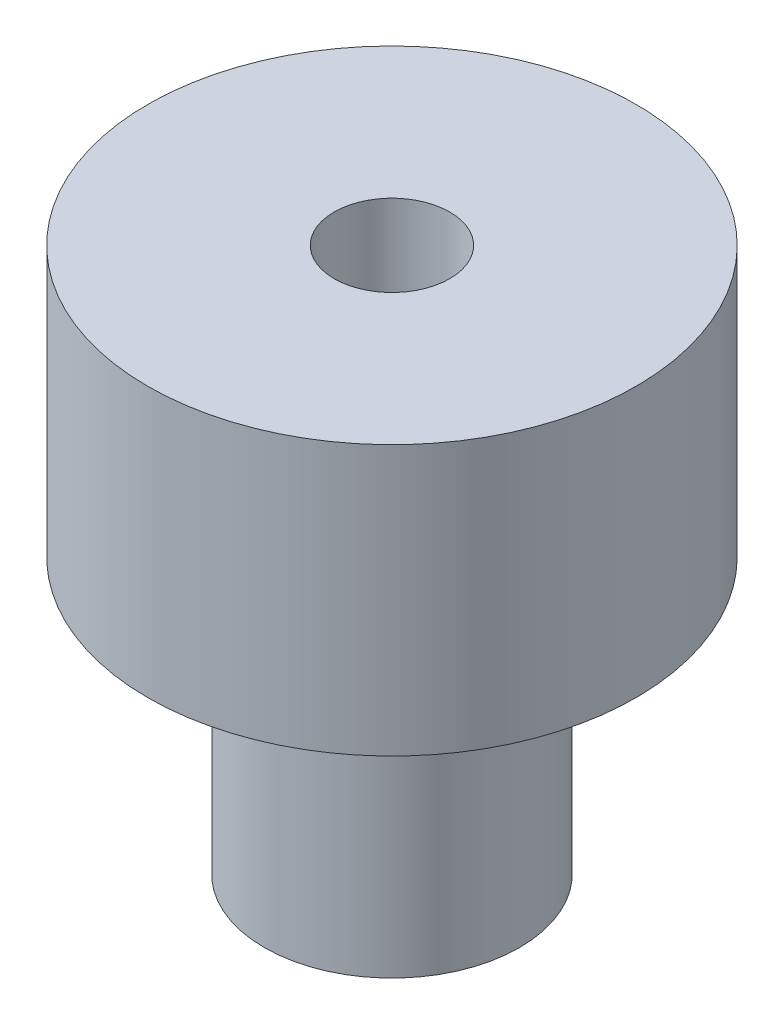
ISO-10303-21;
HEADER;
FILE_DESCRIPTION(('STEP AP214'),'2;1');
FILE_NAME('part.step','',(''),(''),'','','');
FILE_SCHEMA(('AUTOMOTIVE_DESIGN { 1 0 10303 214 1 1 1 1 }'));
ENDSEC;
DATA;
#1=APPLICATION_CONTEXT('core data for automotive mechanical design processes');
#2=APPLICATION_PROTOCOL_DEFINITION('international standard','automotive_design',2000,#1);
#3=PRODUCT_CONTEXT('',#1,'mechanical');
#4=PRODUCT('Part','Part','',(#3));
#5=PRODUCT_RELATED_PRODUCT_CATEGORY('part','',(#4));
#6=PRODUCT_DEFINITION_FORMATION('','',#4);
#7=PRODUCT_DEFINITION_CONTEXT('part definition',#1,'design');
#8=PRODUCT_DEFINITION('design','',#6,#7);
#9=PRODUCT_DEFINITION_SHAPE('','',#8);
#10=(LENGTH_UNIT() NAMED_UNIT(*) SI_UNIT(.MILLI.,.METRE.));
#11=(NAMED_UNIT(*) PLANE_ANGLE_UNIT() SI_UNIT($,.RADIAN.));
#12=(NAMED_UNIT(*) SI_UNIT($,.STERADIAN.) SOLID_ANGLE_UNIT());
#13=UNCERTAINTY_MEASURE_WITH_UNIT(LENGTH_MEASURE(1.E-05),#10,'distance_accuracy_value','');
#14=(GEOMETRIC_REPRESENTATION_CONTEXT(3) GLOBAL_UNCERTAINTY_ASSIGNED_CONTEXT((#13)) GLOBAL_UNIT_ASSIGNED_CONTEXT((#10,
#11,#12)) REPRESENTATION_CONTEXT('',''));
#15=CARTESIAN_POINT('',(0.,0.,0.));
#16=DIRECTION('',(0.,0.,1.));
#17=DIRECTION('',(1.,0.,0.));
#18=AXIS2_PLACEMENT_3D('',#15,#16,#17);
#19=CARTESIAN_POINT('',(0.,0.,0.));
#20=DIRECTION('',(0.,1.,0.));
#21=DIRECTION('',(0.,0.,1.));
#22=AXIS2_PLACEMENT_3D('',#19,#20,#21);
#23=PLANE('',#22);
#24=CARTESIAN_POINT('',(0.,0.,0.));
#25=DIRECTION('',(0.,1.,0.));
#26=DIRECTION('',(0.,0.,1.));
#27=AXIS2_PLACEMENT_3D('',#24,#25,#26);
#28=CIRCLE('',#27,6.7);
#29=CARTESIAN_POINT('',(0.,0.,6.7));
#30=VERTEX_POINT('',#29);
#31=EDGE_CURVE('E62',#30,#30,#28,.T.);
#32=ORIENTED_EDGE('',*,*,#31,.F.);
#33=EDGE_LOOP('',(#32));
#34=FACE_BOUND('',#33,.T.);
#35=CARTESIAN_POINT('',(0.,0.,0.));
#36=DIRECTION('',(0.,1.,0.));
#37=DIRECTION('',(0.,0.,1.));
#38=AXIS2_PLACEMENT_3D('',#35,#36,#37);
#39=CIRCLE('',#38,3.5);
#40=CARTESIAN_POINT('',(0.,0.,3.5));
#41=VERTEX_POINT('',#40);
#42=EDGE_CURVE('E10',#41,#41,#39,.F.);
#43=ORIENTED_EDGE('',*,*,#42,.F.);
#44=EDGE_LOOP('',(#43));
#45=FACE_BOUND('',#44,.T.);
#46=ADVANCED_FACE('F43',(#34,#45),#23,.F.);
#47=CARTESIAN_POINT('',(0.,7.4,0.));
#48=DIRECTION('',(0.,1.,0.));
#49=DIRECTION('',(0.,0.,1.));
#50=AXIS2_PLACEMENT_3D('',#47,#48,#49);
#51=PLANE('',#50);
#52=CARTESIAN_POINT('',(0.,7.4,0.));
#53=DIRECTION('',(0.,1.,0.));
#54=DIRECTION('',(0.,0.,1.));
#55=AXIS2_PLACEMENT_3D('',#52,#53,#54);
#56=CIRCLE('',#55,6.7);
#57=CARTESIAN_POINT('',(0.,7.4,6.7));
#58=VERTEX_POINT('',#57);
#59=EDGE_CURVE('E57',#58,#58,#56,.T.);
#60=ORIENTED_EDGE('',*,*,#59,.T.);
#61=EDGE_LOOP('',(#60));
#62=FACE_BOUND('',#61,.T.);
#63=CARTESIAN_POINT('',(0.,7.4,0.));
#64=DIRECTION('',(0.,1.,0.));
#65=DIRECTION('',(0.,0.,1.));
#66=AXIS2_PLACEMENT_3D('',#63,#64,#65);
#67=CIRCLE('',#66,1.586);
#68=CARTESIAN_POINT('',(0.,7.4,1.586));
#69=VERTEX_POINT('',#68);
#70=EDGE_CURVE('E67',#69,#69,#67,.T.);
#71=ORIENTED_EDGE('',*,*,#70,.F.);
#72=EDGE_LOOP('',(#71));
#73=FACE_BOUND('',#72,.T.);
#74=ADVANCED_FACE('F109',(#62,#73),#51,.T.);
#75=CARTESIAN_POINT('',(0.,7.4,0.));
#76=DIRECTION('',(0.,-1.,0.));
#77=DIRECTION('',(0.,0.,-1.));
#78=AXIS2_PLACEMENT_3D('',#75,#76,#77);
#79=CYLINDRICAL_SURFACE('',#78,6.7);
#80=ORIENTED_EDGE('',*,*,#59,.F.);
#81=EDGE_LOOP('',(#80));
#82=FACE_BOUND('',#81,.T.);
#83=ORIENTED_EDGE('',*,*,#31,.T.);
#84=EDGE_LOOP('',(#83));
#85=FACE_BOUND('',#84,.T.);
#86=ADVANCED_FACE('F45',(#82,#85),#79,.T.);
#87=CARTESIAN_POINT('',(0.,7.4,0.));
#88=DIRECTION('',(0.,-1.,0.));
#89=DIRECTION('',(0.,0.,-1.));
#90=AXIS2_PLACEMENT_3D('',#87,#88,#89);
#91=CYLINDRICAL_SURFACE('',#90,1.586);
#92=CARTESIAN_POINT('',(-0.976163920660868,-3.77,-1.25));
#93=CARTESIAN_POINT('',(-0.976178144988395,-3.72215570902188,-1.24999348367566));
#94=CARTESIAN_POINT('',(-0.979753609791022,-3.67424286982223,-1.24722200464479));
#95=CARTESIAN_POINT('',(-0.993389512883445,-3.5799075950233,-1.23638226412492));
#96=CARTESIAN_POINT('',(-1.00347128585963,-3.53349059203715,-1.22829657532019));
#97=CARTESIAN_POINT('',(-1.03271642932617,-3.42798329293562,-1.20389381365313));
#98=CARTESIAN_POINT('',(-1.05379190652301,-3.36986611649042,-1.18572519301987));
#99=CARTESIAN_POINT('',(-1.10087332936009,-3.2585427689267,-1.14214974593277));
#100=CARTESIAN_POINT('',(-1.12689266322267,-3.20535053043537,-1.11672316839289));
#101=CARTESIAN_POINT('',(-1.19015361848097,-3.08671796004963,-1.04962267083795));
#102=CARTESIAN_POINT('',(-1.22822503181856,-3.02318027040077,-1.00536066722319));
#103=CARTESIAN_POINT('',(-1.30347069374753,-2.90501971582949,-0.905686359127173));
#104=CARTESIAN_POINT('',(-1.34064564511565,-2.85038966049071,-0.850283129560191));
#105=CARTESIAN_POINT('',(-1.40377282323898,-2.76080267075664,-0.740292597501888));
#106=CARTESIAN_POINT('',(-1.43050858345585,-2.72408272943749,-0.687596452138823));
#107=CARTESIAN_POINT('',(-1.47914865475783,-2.65848332231729,-0.575526185755475));
#108=CARTESIAN_POINT('',(-1.50106032765397,-2.6295918940241,-0.516162451879478));
#109=CARTESIAN_POINT('',(-1.53528427502846,-2.58493799161107,-0.401606379457895));
#110=CARTESIAN_POINT('',(-1.54856572237825,-2.567823179102,-0.347234038802782));
#111=CARTESIAN_POINT('',(-1.56942552638147,-2.54106896101829,-0.235616354190177));
#112=CARTESIAN_POINT('',(-1.57700694781528,-2.5314255381542,-0.178372571832662));
#113=CARTESIAN_POINT('',(-1.58584065948328,-2.52019728217196,-0.062415795842604));
#114=CARTESIAN_POINT('',(-1.58707252734326,-2.51863845181772,-0.00369867109623077));
#115=CARTESIAN_POINT('',(-1.58303863653243,-2.52375853903996,0.113148243199622));
#116=CARTESIAN_POINT('',(-1.57777239234197,-2.53043807216249,0.171277988534665));
#117=CARTESIAN_POINT('',(-1.56163097790451,-2.55105227535869,0.282305852081883));
#118=CARTESIAN_POINT('',(-1.55105136603739,-2.56460497621132,0.335320037060864));
#119=CARTESIAN_POINT('',(-1.525215724929,-2.59803614998334,0.43809109978684));
#120=CARTESIAN_POINT('',(-1.50995854849615,-2.61791617475014,0.487847174832266));
#121=CARTESIAN_POINT('',(-1.47398614683566,-2.66546150301338,0.588109903328604));
#122=CARTESIAN_POINT('',(-1.4528791071093,-2.69370429017096,0.638199440052203));
#123=CARTESIAN_POINT('',(-1.40741280950753,-2.7559163547773,0.733046036769301));
#124=CARTESIAN_POINT('',(-1.38305152003341,-2.78988921296571,0.777799732344243));
#125=CARTESIAN_POINT('',(-1.32716389958939,-2.87029303325918,0.87035558701911));
#126=CARTESIAN_POINT('',(-1.29519137530749,-2.91785078926492,0.916908116293664));
#127=CARTESIAN_POINT('',(-1.23067279001101,-3.01952455054259,1.00183996843646));
#128=CARTESIAN_POINT('',(-1.19812615586322,-3.07364746827907,1.040210557265));
#129=CARTESIAN_POINT('',(-1.13930938455981,-3.18102885485554,1.10408735309203));
#130=CARTESIAN_POINT('',(-1.11276563070332,-3.23353360583929,1.13060614320518));
#131=CARTESIAN_POINT('',(-1.06413196833484,-3.34350263483498,1.17649178605274));
#132=CARTESIAN_POINT('',(-1.04203230276013,-3.40095564352018,1.19587438595147));
#133=CARTESIAN_POINT('',(-1.01090436561627,-3.50405053343067,1.22219779601514));
#134=CARTESIAN_POINT('',(-0.999952783472872,-3.54859635800478,1.23109422014854));
#135=CARTESIAN_POINT('',(-0.98385693978719,-3.63938508126608,1.24399829648119));
#136=CARTESIAN_POINT('',(-0.978700967586157,-3.68562436209936,1.24801580837796));
#137=CARTESIAN_POINT('',(-0.975091266979015,-3.77874431333341,1.25083991444511));
#138=CARTESIAN_POINT('',(-0.976667114298413,-3.82562691017024,1.24962351365766));
#139=CARTESIAN_POINT('',(-0.986284142516629,-3.91831835340678,1.24204387009674));
#140=CARTESIAN_POINT('',(-0.994334813921868,-3.96412552198407,1.23567307215736));
#141=CARTESIAN_POINT('',(-1.01861296654447,-4.06631583491505,1.21578316936733));
#142=CARTESIAN_POINT('',(-1.03651729331956,-4.12199083993832,1.20074390187717));
#143=CARTESIAN_POINT('',(-1.07758474078272,-4.22908468830603,1.16403020694476));
#144=CARTESIAN_POINT('',(-1.10076403795871,-4.28048976113271,1.14233529621039));
#145=CARTESIAN_POINT('',(-1.1597930099853,-4.39918136873437,1.08289795329103));
#146=CARTESIAN_POINT('',(-1.19694388286759,-4.46434965684497,1.04222218955419));
#147=CARTESIAN_POINT('',(-1.27148481436731,-4.58613246492364,0.949873129998355));
#148=CARTESIAN_POINT('',(-1.30887483801465,-4.64274820698152,0.898201407959525));
#149=CARTESIAN_POINT('',(-1.37492498640457,-4.7387818821577,0.792627382236269));
#150=CARTESIAN_POINT('',(-1.40405471944933,-4.77950549330536,0.740212236065973));
#151=CARTESIAN_POINT('',(-1.45771693052088,-4.85289814296488,0.627942386310541));
#152=CARTESIAN_POINT('',(-1.48225720504108,-4.88558087155727,0.56810059213634));
#153=CARTESIAN_POINT('',(-1.52089901836077,-4.9363863884743,0.453062756943354));
#154=CARTESIAN_POINT('',(-1.53607935872867,-4.95606231372047,0.398918895409617));
#155=CARTESIAN_POINT('',(-1.56081938370374,-4.98793390505201,0.287231371027705));
#156=CARTESIAN_POINT('',(-1.57038228831186,-5.0001338566545,0.229689676729863));
#157=CARTESIAN_POINT('',(-1.58310687255644,-5.01633740111198,0.112494709102673));
#158=CARTESIAN_POINT('',(-1.58624115973767,-5.0203059204907,0.0528334972756729));
#159=CARTESIAN_POINT('',(-1.58572977925648,-5.01965720679702,-0.0664115082476604));
#160=CARTESIAN_POINT('',(-1.58208462047243,-5.01504061813948,-0.125995307418792));
#161=CARTESIAN_POINT('',(-1.56883709021762,-4.99816052825333,-0.239096397069633));
#162=CARTESIAN_POINT('',(-1.55966247663154,-4.98644581726369,-0.292748812661035));
#163=CARTESIAN_POINT('',(-1.53642061225964,-4.95649956147478,-0.397072546845276));
#164=CARTESIAN_POINT('',(-1.52235217442792,-4.93826643553916,-0.447743138677444));
#165=CARTESIAN_POINT('',(-1.48893959105514,-4.89439476354504,-0.549113229217711));
#166=CARTESIAN_POINT('',(-1.46926598724038,-4.86828427302559,-0.599497523998943));
#167=CARTESIAN_POINT('',(-1.42646754952925,-4.81033413983588,-0.695226882284059));
#168=CARTESIAN_POINT('',(-1.40334111440498,-4.77849183765908,-0.740569590673468));
#169=CARTESIAN_POINT('',(-1.35008340745127,-4.70310214773672,-0.834336489474576));
#170=CARTESIAN_POINT('',(-1.3194676545733,-4.6584838328776,-0.881622466795207));
#171=CARTESIAN_POINT('',(-1.25708769360661,-4.56290055931515,-0.968498216553592));
#172=CARTESIAN_POINT('',(-1.22532198869267,-4.5119271010607,-1.00807749672684));
#173=CARTESIAN_POINT('',(-1.16420351786775,-4.40584279196786,-1.07800852473263));
#174=CARTESIAN_POINT('',(-1.13480519306932,-4.35093998006325,-1.10863541079242));
#175=CARTESIAN_POINT('',(-1.08023587088671,-4.23539789465086,-1.16186609852798));
#176=CARTESIAN_POINT('',(-1.05505722319322,-4.17476932111139,-1.18448450436969));
#177=CARTESIAN_POINT('',(-1.0195339027873,-4.06713942002999,-1.21504048019102));
#178=CARTESIAN_POINT('',(-1.00700567532186,-4.02154675597413,-1.2253485292819));
#179=CARTESIAN_POINT('',(-0.9878890804814,-3.92835725468946,-1.24081830447534));
#180=CARTESIAN_POINT('',(-0.981278208722362,-3.88076873747495,-1.24599953645513));
#181=CARTESIAN_POINT('',(-0.976836622823037,-3.81195903986128,-1.24947373926169));
#182=CARTESIAN_POINT('',(-0.976157681392682,-3.7909861142506,-1.2500028582789));
#183=CARTESIAN_POINT('',(-0.976163920660868,-3.77,-1.25));
#184=B_SPLINE_CURVE_WITH_KNOTS('',3,(#92,#93,#94,#95,#96,#97,#98,#99,#100,#101,#102,#103,#104,
#105,#106,#107,#108,#109,#110,#111,#112,#113,#114,#115,#116,#117,#118,#119,#120,#121,#122,#123,
#124,#125,#126,#127,#128,#129,#130,#131,#132,#133,#134,#135,#136,#137,#138,#139,#140,#141,#142,
#143,#144,#145,#146,#147,#148,#149,#150,#151,#152,#153,#154,#155,#156,#157,#158,#159,#160,#161,
#162,#163,#164,#165,#166,#167,#168,#169,#170,#171,#172,#173,#174,#175,#176,#177,#178,#179,#180,
#181,#182,#183),.UNSPECIFIED.,.T.,.F.,(4,2,2,2,2,2,2,2,2,2,2,2,2,2,2,2,2,2,2,2,2,2,2,2,2,2,2,2,
2,2,2,2,2,2,2,2,2,2,2,2,2,2,2,2,2,4),(0.,0.143458905345652,0.287390630289864,0.479613786784046,
0.672365110493068,0.929985838085592,1.18739756850535,1.39531797014155,1.60291884043558,
1.77775976263962,1.95250660930709,2.12781515349428,2.30313679700879,2.46963675374467,
2.63617757797761,2.8192746786572,3.00248662411448,3.22318257958916,3.44411295660239,
3.63714766439245,3.8297538198033,3.96940074965816,4.10876499763778,4.24874215983964,
4.38892486902238,4.56907413116541,4.74978347592084,5.00450415697558,5.25918840600166,
5.47581450997308,5.69206920237976,5.87005081283846,6.04793030168197,6.22656617675573,
6.40518864361556,6.57150397836586,6.73785968272188,6.91738357978343,7.09699098996296,
7.31180509610172,7.52690964632224,7.73446356282929,7.94163701319313,8.08629345995527,
8.23039739494754,8.2933232930286),.UNSPECIFIED.);
#185=CARTESIAN_POINT('',(-0.976163920660868,-3.77,-1.25));
#186=VERTEX_POINT('',#185);
#187=EDGE_CURVE('E80',#186,#186,#184,.T.);
#188=ORIENTED_EDGE('',*,*,#187,.F.);
#189=EDGE_LOOP('',(#188));
#190=FACE_BOUND('',#189,.T.);
#191=ORIENTED_EDGE('',*,*,#70,.T.);
#192=EDGE_LOOP('',(#191));
#193=FACE_BOUND('',#192,.T.);
#194=CARTESIAN_POINT('',(0.,-7.54,0.));
#195=DIRECTION('',(0.,-1.,0.));
#196=DIRECTION('',(0.,0.,-1.));
#197=AXIS2_PLACEMENT_3D('',#194,#195,#196);
#198=CIRCLE('',#197,1.586);
#199=CARTESIAN_POINT('',(0.,-7.54,-1.586));
#200=VERTEX_POINT('',#199);
#201=EDGE_CURVE('E76',#200,#200,#198,.T.);
#202=ORIENTED_EDGE('',*,*,#201,.T.);
#203=EDGE_LOOP('',(#202));
#204=FACE_BOUND('',#203,.T.);
#205=ADVANCED_FACE('F87',(#190,#193,#204),#91,.F.);
#206=CARTESIAN_POINT('',(0.,-7.54,0.));
#207=DIRECTION('',(0.,-1.,0.));
#208=DIRECTION('',(0.,0.,-1.));
#209=AXIS2_PLACEMENT_3D('',#206,#207,#208);
#210=PLANE('',#209);
#211=CARTESIAN_POINT('',(0.,-7.54,0.));
#212=DIRECTION('',(0.,-1.,0.));
#213=DIRECTION('',(0.,0.,-1.));
#214=AXIS2_PLACEMENT_3D('',#211,#212,#213);
#215=CIRCLE('',#214,3.5);
#216=CARTESIAN_POINT('',(0.,-7.54,-3.5));
#217=VERTEX_POINT('',#216);
#218=EDGE_CURVE('E72',#217,#217,#215,.T.);
#219=ORIENTED_EDGE('',*,*,#218,.T.);
#220=EDGE_LOOP('',(#219));
#221=FACE_BOUND('',#220,.T.);
#222=ORIENTED_EDGE('',*,*,#201,.F.);
#223=EDGE_LOOP('',(#222));
#224=FACE_BOUND('',#223,.T.);
#225=ADVANCED_FACE('F96',(#221,#224),#210,.T.);
#226=CARTESIAN_POINT('',(0.,-7.54,0.));
#227=DIRECTION('',(0.,1.,0.));
#228=DIRECTION('',(0.,0.,1.));
#229=AXIS2_PLACEMENT_3D('',#226,#227,#228);
#230=CYLINDRICAL_SURFACE('',#229,3.5);
#231=CARTESIAN_POINT('',(-3.2691742076555,-3.77,-1.25));
#232=CARTESIAN_POINT('',(-3.26917292438196,-3.70223646881701,-1.2500014657168));
#233=CARTESIAN_POINT('',(-3.27130407050731,-3.63448306822128,-1.24447124723087));
#234=CARTESIAN_POINT('',(-3.27954557728381,-3.50100354053551,-1.22258548426208));
#235=CARTESIAN_POINT('',(-3.28565613446978,-3.43527751374117,-1.20622940511182));
#236=CARTESIAN_POINT('',(-3.30107790836764,-3.30781262046205,-1.16335593318025));
#237=CARTESIAN_POINT('',(-3.3103820813109,-3.24606533157396,-1.13686088802958));
#238=CARTESIAN_POINT('',(-3.33113188929166,-3.12786956560526,-1.07453961334162));
#239=CARTESIAN_POINT('',(-3.34257809808702,-3.07142251432457,-1.03871088270724));
#240=CARTESIAN_POINT('',(-3.36689966125499,-2.96288940054369,-0.957012237945704));
#241=CARTESIAN_POINT('',(-3.37981431712589,-2.91107606896804,-0.910791620570068));
#242=CARTESIAN_POINT('',(-3.40528790174668,-2.81574657565947,-0.810367255990525));
#243=CARTESIAN_POINT('',(-3.41784676295918,-2.77223198033609,-0.756162005080267));
#244=CARTESIAN_POINT('',(-3.4416554889862,-2.69345545657362,-0.639270438808907));
#245=CARTESIAN_POINT('',(-3.45285383406514,-2.65848525378488,-0.576376093851267));
#246=CARTESIAN_POINT('',(-3.47221153381931,-2.59973247227305,-0.445127531707925));
#247=CARTESIAN_POINT('',(-3.48037183737504,-2.5759463997661,-0.376775027399535));
#248=CARTESIAN_POINT('',(-3.49245530799316,-2.54117952559996,-0.239414363324649));
#249=CARTESIAN_POINT('',(-3.49653304673083,-2.52973021988224,-0.170538642602653));
#250=CARTESIAN_POINT('',(-3.50054398952422,-2.51846580508615,-0.0317308606240278));
#251=CARTESIAN_POINT('',(-3.50047841683989,-2.5186472621734,0.0382008827594682));
#252=CARTESIAN_POINT('',(-3.49631130383425,-2.53035559878231,0.173796186747276));
#253=CARTESIAN_POINT('',(-3.49239127067778,-2.54137225319108,0.239510325909295));
#254=CARTESIAN_POINT('',(-3.4811892594591,-2.57358642557157,0.368087065850937));
#255=CARTESIAN_POINT('',(-3.47390704664955,-2.59478465442487,0.430949467185625));
#256=CARTESIAN_POINT('',(-3.45658253893038,-2.64702345791291,0.553080483404854));
#257=CARTESIAN_POINT('',(-3.44650297132745,-2.67819788349761,0.612286340929431));
#258=CARTESIAN_POINT('',(-3.4246167895169,-2.74938957004896,0.724767597934832));
#259=CARTESIAN_POINT('',(-3.41280964940655,-2.7894095256478,0.778041182802281));
#260=CARTESIAN_POINT('',(-3.38795176821394,-2.87966538796732,0.880166240160418));
#261=CARTESIAN_POINT('',(-3.37486828997372,-2.93033345097223,0.928628391331526));
#262=CARTESIAN_POINT('',(-3.34944981191468,-3.0391717437094,1.01650555440789));
#263=CARTESIAN_POINT('',(-3.33711496612903,-3.09734350970569,1.05591870906859));
#264=CARTESIAN_POINT('',(-3.31439562189586,-3.22093882597788,1.12522950569523));
#265=CARTESIAN_POINT('',(-3.3040513832118,-3.28647653328192,1.15493781879361));
#266=CARTESIAN_POINT('',(-3.28694869806869,-3.42208972604739,1.20275553291115));
#267=CARTESIAN_POINT('',(-3.2801884778585,-3.49216294755289,1.22087067237907));
#268=CARTESIAN_POINT('',(-3.27143002768992,-3.63104194286793,1.24414358032316));
#269=CARTESIAN_POINT('',(-3.26920708180296,-3.69973090633461,1.24991352345505));
#270=CARTESIAN_POINT('',(-3.26914209334096,-3.83711668761275,1.25008448921425));
#271=CARTESIAN_POINT('',(-3.27129909588941,-3.90581350044805,1.24448798984991));
#272=CARTESIAN_POINT('',(-3.27952452452363,-4.03828688736255,1.22263799772668));
#273=CARTESIAN_POINT('',(-3.28542708774359,-4.10214937178817,1.20683592994393));
#274=CARTESIAN_POINT('',(-3.30028809464655,-4.22629495749711,1.16557961975037));
#275=CARTESIAN_POINT('',(-3.30924712838686,-4.28657736499969,1.14012351350351));
#276=CARTESIAN_POINT('',(-3.32959948938642,-4.40420008874396,1.07927201741359));
#277=CARTESIAN_POINT('',(-3.34106719910993,-4.46136296289128,1.04355922754481));
#278=CARTESIAN_POINT('',(-3.3650114872521,-4.56910386040154,0.963555281036771));
#279=CARTESIAN_POINT('',(-3.3774884033877,-4.61967966459128,0.919261245827038));
#280=CARTESIAN_POINT('',(-3.40289783219847,-4.71577134499811,0.820385217502025));
#281=CARTESIAN_POINT('',(-3.41581623964053,-4.76083969273136,0.765363258315928));
#282=CARTESIAN_POINT('',(-3.43996864684916,-4.84114634252536,0.64821857181739));
#283=CARTESIAN_POINT('',(-3.45120267476866,-4.87638480889246,0.586095963216703));
#284=CARTESIAN_POINT('',(-3.47068992079872,-4.93575011170409,0.456690236963214));
#285=CARTESIAN_POINT('',(-3.47895813089701,-4.95993300873034,0.389435219661488));
#286=CARTESIAN_POINT('',(-3.49164167991555,-4.99652342952858,0.251453449460869));
#287=CARTESIAN_POINT('',(-3.49605864126052,-5.00893591204424,0.180728171763231));
#288=CARTESIAN_POINT('',(-3.50040190941305,-5.02113648332217,0.0418787546430673));
#289=CARTESIAN_POINT('',(-3.50055532713249,-5.02156305322447,-0.0261827249779375));
#290=CARTESIAN_POINT('',(-3.49693182545721,-5.01139231150664,-0.161363401845738));
#291=CARTESIAN_POINT('',(-3.49315530819592,-5.00079612779777,-0.228482694790275));
#292=CARTESIAN_POINT('',(-3.48219155536997,-4.96931993535221,-0.3584906611653));
#293=CARTESIAN_POINT('',(-3.47507564040231,-4.94865463831576,-0.42143777799965));
#294=CARTESIAN_POINT('',(-3.45816943849313,-4.89783345463454,-0.542985717130838));
#295=CARTESIAN_POINT('',(-3.44837865047326,-4.8676757896432,-0.601585722474542));
#296=CARTESIAN_POINT('',(-3.42662745242743,-4.79734432383809,-0.71534116903704));
#297=CARTESIAN_POINT('',(-3.41459585580279,-4.75681776245079,-0.770264674501974));
#298=CARTESIAN_POINT('',(-3.3898552302368,-4.66747377040415,-0.872734236383779));
#299=CARTESIAN_POINT('',(-3.37714597079416,-4.61865350620834,-0.920277760776972));
#300=CARTESIAN_POINT('',(-3.35176441921256,-4.51139058641294,-1.00891110432271));
#301=CARTESIAN_POINT('',(-3.33912156501336,-4.45260506129054,-1.04959590102612));
#302=CARTESIAN_POINT('',(-3.31600175800823,-4.32863079284462,-1.12050399405574));
#303=CARTESIAN_POINT('',(-3.30552465910575,-4.26344248187529,-1.15072799613439));
#304=CARTESIAN_POINT('',(-3.28804606616516,-4.12812953808138,-1.19976666603697));
#305=CARTESIAN_POINT('',(-3.28105913209347,-4.05798559681381,-1.21853360937359));
#306=CARTESIAN_POINT('',(-3.27162502953463,-3.9152230532312,-1.24364637412568));
#307=CARTESIAN_POINT('',(-3.26917558262796,-3.84260571155641,-1.24999842954744));
#308=CARTESIAN_POINT('',(-3.2691742076555,-3.77,-1.25));
#309=B_SPLINE_CURVE_WITH_KNOTS('',3,(#231,#232,#233,#234,#235,#236,#237,#238,#239,#240,#241,
#242,#243,#244,#245,#246,#247,#248,#249,#250,#251,#252,#253,#254,#255,#256,#257,#258,#259,#260,
#261,#262,#263,#264,#265,#266,#267,#268,#269,#270,#271,#272,#273,#274,#275,#276,#277,#278,#279,
#280,#281,#282,#283,#284,#285,#286,#287,#288,#289,#290,#291,#292,#293,#294,#295,#296,#297,#298,
#299,#300,#301,#302,#303,#304,#305,#306,#307,#308),.UNSPECIFIED.,.T.,.F.,(4,2,2,2,2,2,2,2,2,2,2,
2,2,2,2,2,2,2,2,2,2,2,2,2,2,2,2,2,2,2,2,2,2,2,2,2,2,2,4),(0.,0.203020883138165,
0.406051793815672,0.608637751162819,0.811278050310596,1.02220501259777,1.23317174861701,
1.45056406841855,1.66788843235756,1.8766323011199,2.08531454120127,2.28461868668642,
2.48393674968961,2.68604985529561,2.88822461610465,3.10122083881643,3.31426073854221,
3.53123804647412,3.74810787062262,3.95394726789477,4.15974179475175,4.35700470913191,
4.55430572705358,4.75852942964242,4.96282175786679,5.17866024153272,5.39449511724439,
5.60922305543413,5.82386049090848,6.02704135069306,6.23020142189366,6.42920732216897,
6.6282505273945,6.83526508050384,7.04235050272176,7.25910581081151,7.47584649234335,
7.69348395638331,7.91101210793804),.UNSPECIFIED.);
#310=CARTESIAN_POINT('',(-3.2691742076555,-3.77,-1.25));
#311=VERTEX_POINT('',#310);
#312=EDGE_CURVE('E47',#311,#311,#309,.T.);
#313=ORIENTED_EDGE('',*,*,#312,.T.);
#314=EDGE_LOOP('',(#313));
#315=FACE_BOUND('',#314,.T.);
#316=ORIENTED_EDGE('',*,*,#218,.F.);
#317=EDGE_LOOP('',(#316));
#318=FACE_BOUND('',#317,.T.);
#319=ORIENTED_EDGE('',*,*,#42,.T.);
#320=EDGE_LOOP('',(#319));
#321=FACE_BOUND('',#320,.T.);
#322=ADVANCED_FACE('F94',(#315,#318,#321),#230,.T.);
#323=CARTESIAN_POINT('',(-10.,-3.77,0.));
#324=DIRECTION('',(1.,0.,0.));
#325=DIRECTION('',(0.,0.,-1.));
#326=AXIS2_PLACEMENT_3D('',#323,#324,#325);
#327=CYLINDRICAL_SURFACE('',#326,1.25);
#328=ORIENTED_EDGE('',*,*,#187,.T.);
#329=EDGE_LOOP('',(#328));
#330=FACE_BOUND('',#329,.T.);
#331=ORIENTED_EDGE('',*,*,#312,.F.);
#332=EDGE_LOOP('',(#331));
#333=FACE_BOUND('',#332,.T.);
#334=ADVANCED_FACE('F90',(#330,#333),#327,.F.);
#335=CLOSED_SHELL('',(#46,#74,#86,#205,#225,#322,#334));
#336=MANIFOLD_SOLID_BREP('B2',#335);
#337=ADVANCED_BREP_SHAPE_REPRESENTATION('',(#18,#336),#14);
#338=SHAPE_DEFINITION_REPRESENTATION(#9,#337);
ENDSEC;
END-ISO-10303-21;
